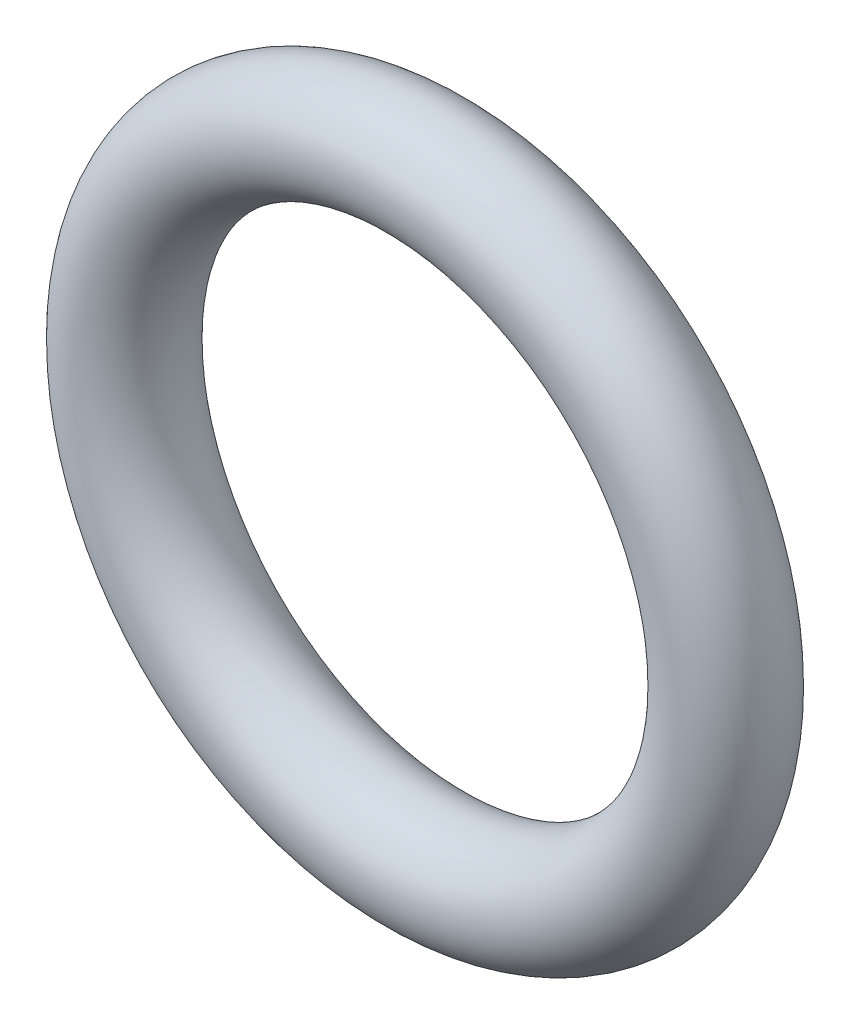
ISO-10303-21;
HEADER;
FILE_DESCRIPTION(('STEP AP214'),'2;1');
FILE_NAME('part.step','',(''),(''),'','','');
FILE_SCHEMA(('AUTOMOTIVE_DESIGN { 1 0 10303 214 1 1 1 1 }'));
ENDSEC;
DATA;
#1=APPLICATION_CONTEXT('core data for automotive mechanical design processes');
#2=APPLICATION_PROTOCOL_DEFINITION('international standard','automotive_design',2000,#1);
#3=PRODUCT_CONTEXT('',#1,'mechanical');
#4=PRODUCT('Part','Part','',(#3));
#5=PRODUCT_RELATED_PRODUCT_CATEGORY('part','',(#4));
#6=PRODUCT_DEFINITION_FORMATION('','',#4);
#7=PRODUCT_DEFINITION_CONTEXT('part definition',#1,'design');
#8=PRODUCT_DEFINITION('design','',#6,#7);
#9=PRODUCT_DEFINITION_SHAPE('','',#8);
#10=(LENGTH_UNIT() NAMED_UNIT(*) SI_UNIT(.MILLI.,.METRE.));
#11=(NAMED_UNIT(*) PLANE_ANGLE_UNIT() SI_UNIT($,.RADIAN.));
#12=(NAMED_UNIT(*) SI_UNIT($,.STERADIAN.) SOLID_ANGLE_UNIT());
#13=UNCERTAINTY_MEASURE_WITH_UNIT(LENGTH_MEASURE(1.E-05),#10,'distance_accuracy_value','');
#14=(GEOMETRIC_REPRESENTATION_CONTEXT(3) GLOBAL_UNCERTAINTY_ASSIGNED_CONTEXT((#13)) GLOBAL_UNIT_ASSIGNED_CONTEXT((#10,
#11,#12)) REPRESENTATION_CONTEXT('',''));
#15=CARTESIAN_POINT('',(0.,0.,0.));
#16=DIRECTION('',(0.,0.,1.));
#17=DIRECTION('',(1.,0.,0.));
#18=AXIS2_PLACEMENT_3D('',#15,#16,#17);
#19=CARTESIAN_POINT('',(0.,0.,0.));
#20=DIRECTION('',(0.,0.,-1.));
#21=DIRECTION('',(-1.,0.,0.));
#22=AXIS2_PLACEMENT_3D('',#19,#20,#21);
#23=TOROIDAL_SURFACE('',#22,4.85775,0.889);
#24=CARTESIAN_POINT('',(-5.74675,0.,0.));
#25=VERTEX_POINT('',#24);
#26=VERTEX_LOOP('',#25);
#27=FACE_BOUND('',#26,.T.);
#28=ADVANCED_FACE('F33',(#27),#23,.T.);
#29=CLOSED_SHELL('',(#28));
#30=MANIFOLD_SOLID_BREP('B2',#29);
#31=ADVANCED_BREP_SHAPE_REPRESENTATION('',(#18,#30),#14);
#32=SHAPE_DEFINITION_REPRESENTATION(#9,#31);
ENDSEC;
END-ISO-10303-21;
